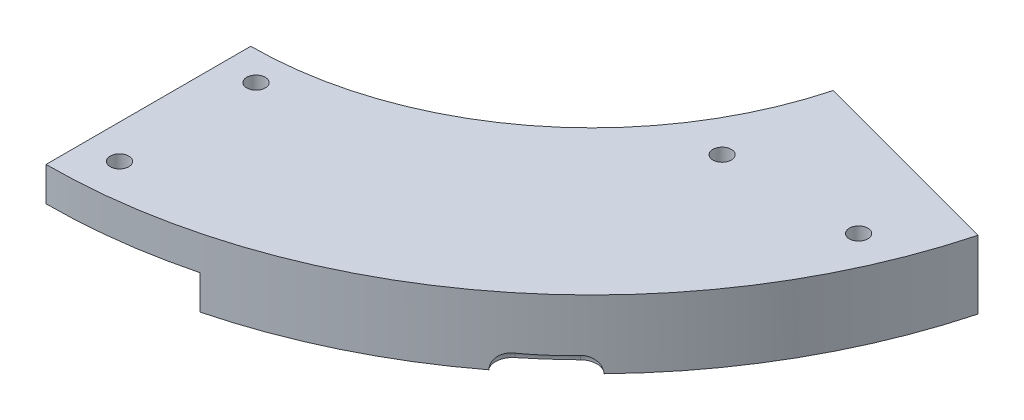
ISO-10303-21;
HEADER;
FILE_DESCRIPTION(('STEP AP214'),'2;1');
FILE_NAME('part.step','',(''),(''),'','','');
FILE_SCHEMA(('AUTOMOTIVE_DESIGN { 1 0 10303 214 1 1 1 1 }'));
ENDSEC;
DATA;
#1=APPLICATION_CONTEXT('core data for automotive mechanical design processes');
#2=APPLICATION_PROTOCOL_DEFINITION('international standard','automotive_design',2000,#1);
#3=PRODUCT_CONTEXT('',#1,'mechanical');
#4=PRODUCT('Part','Part','',(#3));
#5=PRODUCT_RELATED_PRODUCT_CATEGORY('part','',(#4));
#6=PRODUCT_DEFINITION_FORMATION('','',#4);
#7=PRODUCT_DEFINITION_CONTEXT('part definition',#1,'design');
#8=PRODUCT_DEFINITION('design','',#6,#7);
#9=PRODUCT_DEFINITION_SHAPE('','',#8);
#10=(LENGTH_UNIT() NAMED_UNIT(*) SI_UNIT(.MILLI.,.METRE.));
#11=(NAMED_UNIT(*) PLANE_ANGLE_UNIT() SI_UNIT($,.RADIAN.));
#12=(NAMED_UNIT(*) SI_UNIT($,.STERADIAN.) SOLID_ANGLE_UNIT());
#13=UNCERTAINTY_MEASURE_WITH_UNIT(LENGTH_MEASURE(1.E-05),#10,'distance_accuracy_value','');
#14=(GEOMETRIC_REPRESENTATION_CONTEXT(3) GLOBAL_UNCERTAINTY_ASSIGNED_CONTEXT((#13)) GLOBAL_UNIT_ASSIGNED_CONTEXT((#10,
#11,#12)) REPRESENTATION_CONTEXT('',''));
#15=CARTESIAN_POINT('',(0.,0.,0.));
#16=DIRECTION('',(0.,0.,1.));
#17=DIRECTION('',(1.,0.,0.));
#18=AXIS2_PLACEMENT_3D('',#15,#16,#17);
#19=CARTESIAN_POINT('',(0.,-6.35,0.));
#20=DIRECTION('',(0.,1.,0.));
#21=DIRECTION('',(0.,0.,1.));
#22=AXIS2_PLACEMENT_3D('',#19,#20,#21);
#23=PLANE('',#22);
#24=CARTESIAN_POINT('',(-6.34999999999999,-6.35,-94.267465262));
#25=DIRECTION('',(0.,1.,0.));
#26=DIRECTION('',(0.,0.,1.));
#27=AXIS2_PLACEMENT_3D('',#24,#25,#26);
#28=CIRCLE('',#27,101.6);
#29=CARTESIAN_POINT('',(91.7880639509695,-6.35,-67.9714502795843));
#30=VERTEX_POINT('',#29);
#31=CARTESIAN_POINT('',(66.609934624812,-6.35,-23.5609737669247));
#32=VERTEX_POINT('',#31);
#33=EDGE_CURVE('E157',#30,#32,#28,.F.);
#34=ORIENTED_EDGE('',*,*,#33,.T.);
#35=CARTESIAN_POINT('',(64.3650015378368,-6.35,-21.3157788010022));
#36=DIRECTION('',(0.,1.,0.));
#37=DIRECTION('',(0.,0.,1.));
#38=AXIS2_PLACEMENT_3D('',#35,#36,#37);
#39=CIRCLE('',#38,3.17500000000001);
#40=CARTESIAN_POINT('',(62.1551577397794,-6.35,-23.5955190029084));
#41=VERTEX_POINT('',#40);
#42=EDGE_CURVE('E144',#32,#41,#39,.T.);
#43=ORIENTED_EDGE('',*,*,#42,.T.);
#44=CARTESIAN_POINT('',(-6.34999999999999,-6.35,-94.267465262));
#45=DIRECTION('',(0.,1.,0.));
#46=DIRECTION('',(0.,0.,1.));
#47=AXIS2_PLACEMENT_3D('',#44,#45,#46);
#48=CIRCLE('',#47,98.425);
#49=CARTESIAN_POINT('',(55.7350089646732,-6.35,-17.8938291900122));
#50=VERTEX_POINT('',#49);
#51=EDGE_CURVE('E360',#41,#50,#48,.F.);
#52=ORIENTED_EDGE('',*,*,#51,.T.);
#53=CARTESIAN_POINT('',(57.7377511893401,-6.35,-15.4301635102706));
#54=DIRECTION('',(0.,1.,0.));
#55=DIRECTION('',(0.,0.,1.));
#56=AXIS2_PLACEMENT_3D('',#53,#54,#55);
#57=CIRCLE('',#56,3.175);
#58=CARTESIAN_POINT('',(55.2430934211356,-6.35,-13.4661605521423));
#59=VERTEX_POINT('',#58);
#60=EDGE_CURVE('E152',#50,#59,#57,.T.);
#61=ORIENTED_EDGE('',*,*,#60,.T.);
#62=CARTESIAN_POINT('',(19.05,-6.35,4.1063117316684));
#63=VERTEX_POINT('',#62);
#64=EDGE_CURVE('E165',#59,#63,#28,.F.);
#65=ORIENTED_EDGE('',*,*,#64,.T.);
#66=DIRECTION('',(0.,0.,-1.));
#67=VECTOR('',#66,1.);
#68=CARTESIAN_POINT('',(19.05,-6.35,0.));
#69=LINE('',#68,#67);
#70=CARTESIAN_POINT('',(19.05,-6.35000000000001,-9.32758866940955));
#71=VERTEX_POINT('',#70);
#72=EDGE_CURVE('E169',#63,#71,#69,.T.);
#73=ORIENTED_EDGE('',*,*,#72,.T.);
#74=CARTESIAN_POINT('',(59.2307860808822,-6.34999999999998,-34.6092496575072));
#75=CARTESIAN_POINT('',(53.9014840663634,-6.34999999999998,-28.753781836006));
#76=CARTESIAN_POINT('',(47.7126525344251,-6.34999999999998,-23.5402136265929));
#77=CARTESIAN_POINT('',(34.0840577834186,-6.34999999999998,-14.9609190133976));
#78=CARTESIAN_POINT('',(26.6877525453769,-6.34999999999671,-11.6096261559123));
#79=CARTESIAN_POINT('',(18.6746195889176,-6.35000000000014,-9.21543378527847));
#80=CARTESIAN_POINT('',(18.296166475289,-6.34999999999998,-9.10439786983044));
#81=CARTESIAN_POINT('',(17.9206079167567,-6.34999999999998,-8.99642515905449));
#82=B_SPLINE_CURVE_WITH_KNOTS('',3,(#74,#75,#76,#77,#78,#79,#80,#81),.UNSPECIFIED.,.F.,.F.,(4,2,
2,4),(0.,0.488007694164067,0.976015388328135,1.),.UNSPECIFIED.);
#83=CARTESIAN_POINT('',(59.2307860808822,-6.34999999999999,-34.6092496575072));
#84=VERTEX_POINT('',#83);
#85=EDGE_CURVE('E268',#84,#71,#82,.T.);
#86=ORIENTED_EDGE('',*,*,#85,.F.);
#87=DIRECTION('',(0.515920464794379,0.,0.856636488836631));
#88=VECTOR('',#87,1.);
#89=CARTESIAN_POINT('',(64.0430813094094,-6.35,-26.6188946142084));
#90=LINE('',#89,#88);
#91=CARTESIAN_POINT('',(54.063522539709,-6.35,-43.1889955657612));
#92=VERTEX_POINT('',#91);
#93=EDGE_CURVE('E275',#92,#84,#90,.T.);
#94=ORIENTED_EDGE('',*,*,#93,.F.);
#95=CARTESIAN_POINT('',(54.063522539709,-6.34999999999998,-43.1889955657612));
#96=CARTESIAN_POINT('',(49.5107747784138,-6.34999999999998,-37.8008034006709));
#97=CARTESIAN_POINT('',(44.1383057302959,-6.34999999999998,-32.9416564163539));
#98=CARTESIAN_POINT('',(32.2865263150446,-6.34999999999998,-24.8569769230008));
#99=CARTESIAN_POINT('',(25.7750626710049,-6.34999999999998,-21.6252465632108));
#100=CARTESIAN_POINT('',(18.7194764886662,-6.34999999999998,-19.2310542036305));
#101=CARTESIAN_POINT('',(18.3817175174875,-6.34999999999998,-19.1197151915227));
#102=CARTESIAN_POINT('',(18.0455634429701,-6.34999999999998,-19.011266069953));
#103=B_SPLINE_CURVE_WITH_KNOTS('',3,(#95,#96,#97,#98,#99,#100,#101,#102),.UNSPECIFIED.,.F.,.F.,
(4,2,2,4),(0.,0.488007694164067,0.976015388328135,1.),.UNSPECIFIED.);
#104=CARTESIAN_POINT('',(19.0499998347804,-6.35,-19.3432110988143));
#105=VERTEX_POINT('',#104);
#106=EDGE_CURVE('E73',#92,#105,#103,.T.);
#107=ORIENTED_EDGE('',*,*,#106,.T.);
#108=CARTESIAN_POINT('',(19.05,-6.35,-29.179965262));
#109=VERTEX_POINT('',#108);
#110=EDGE_CURVE('E227',#105,#109,#69,.T.);
#111=ORIENTED_EDGE('',*,*,#110,.T.);
#112=CARTESIAN_POINT('',(19.05,-6.35,-30.767465262));
#113=DIRECTION('',(0.,1.,0.));
#114=DIRECTION('',(0.,0.,1.));
#115=AXIS2_PLACEMENT_3D('',#112,#113,#114);
#116=CIRCLE('',#115,1.5875);
#117=CARTESIAN_POINT('',(17.6278728360681,-6.35,-31.472951321116));
#118=VERTEX_POINT('',#117);
#119=EDGE_CURVE('E229',#118,#109,#116,.F.);
#120=ORIENTED_EDGE('',*,*,#119,.F.);
#121=DIRECTION('',(-0.895828134760231,0.,-0.444400667159721));
#122=VECTOR('',#121,1.);
#123=CARTESIAN_POINT('',(16.0109533285498,-6.35,-32.2750695846567));
#124=LINE('',#123,#122);
#125=CARTESIAN_POINT('',(12.9770144535497,-6.35,-33.7801400416509));
#126=VERTEX_POINT('',#125);
#127=EDGE_CURVE('E186',#118,#126,#124,.T.);
#128=ORIENTED_EDGE('',*,*,#127,.T.);
#129=CARTESIAN_POINT('',(-6.34999999999999,-6.35,-94.267465262));
#130=DIRECTION('',(0.,1.,0.));
#131=DIRECTION('',(0.,0.,1.));
#132=AXIS2_PLACEMENT_3D('',#129,#130,#131);
#133=CIRCLE('',#132,63.5);
#134=CARTESIAN_POINT('',(54.9862899693559,-6.35,-77.8324558979902));
#135=VERTEX_POINT('',#134);
#136=EDGE_CURVE('E167',#135,#126,#133,.F.);
#137=ORIENTED_EDGE('',*,*,#136,.F.);
#138=DIRECTION('',(-0.965925826289069,0.,-0.258819045102517));
#139=VECTOR('',#138,1.);
#140=CARTESIAN_POINT('',(23.1414969725153,-6.35,-86.3652424646298));
#141=LINE('',#140,#139);
#142=EDGE_CURVE('E164',#30,#135,#141,.T.);
#143=ORIENTED_EDGE('',*,*,#142,.F.);
#144=EDGE_LOOP('',(#34,#43,#52,#61,#65,#73,#86,#94,#107,#111,#120,#128,#137,#143));
#145=FACE_BOUND('',#144,.T.);
#146=CARTESIAN_POINT('',(80.391,-6.35,-57.15));
#147=DIRECTION('',(0.,-1.,0.));
#148=DIRECTION('',(0.,0.,-1.));
#149=AXIS2_PLACEMENT_3D('',#146,#147,#148);
#150=CIRCLE('',#149,1.72719999999998);
#151=CARTESIAN_POINT('',(80.391,-6.35,-58.8772));
#152=VERTEX_POINT('',#151);
#153=EDGE_CURVE('E381',#152,#152,#150,.T.);
#154=ORIENTED_EDGE('',*,*,#153,.F.);
#155=EDGE_LOOP('',(#154));
#156=FACE_BOUND('',#155,.T.);
#157=CARTESIAN_POINT('',(54.991,-6.35,-57.15));
#158=DIRECTION('',(0.,-1.,0.));
#159=DIRECTION('',(0.,0.,-1.));
#160=AXIS2_PLACEMENT_3D('',#157,#158,#159);
#161=CIRCLE('',#160,1.72719999999999);
#162=CARTESIAN_POINT('',(54.991,-6.35,-58.8772));
#163=VERTEX_POINT('',#162);
#164=EDGE_CURVE('E387',#163,#163,#161,.T.);
#165=ORIENTED_EDGE('',*,*,#164,.F.);
#166=EDGE_LOOP('',(#165));
#167=FACE_BOUND('',#166,.T.);
#168=ADVANCED_FACE('F47',(#145,#156,#167),#23,.F.);
#169=CARTESIAN_POINT('',(19.05,-6.35,0.));
#170=DIRECTION('',(1.,0.,0.));
#171=DIRECTION('',(0.,0.,-1.));
#172=AXIS2_PLACEMENT_3D('',#169,#170,#171);
#173=PLANE('',#172);
#174=CARTESIAN_POINT('',(19.05,-6.34999999999998,-9.32759127987919));
#175=CARTESIAN_POINT('',(19.05,-6.34877044993828,-9.43975511956092));
#176=CARTESIAN_POINT('',(19.05,-6.34691619703676,-9.55193077200282));
#177=CARTESIAN_POINT('',(19.05,-6.34099239613251,-9.77726515650753));
#178=CARTESIAN_POINT('',(19.05,-6.33690239360589,-9.89042332273259));
#179=CARTESIAN_POINT('',(19.05,-6.3255017358533,-10.1171280988849));
#180=CARTESIAN_POINT('',(19.05,-6.31817588974514,-10.2306740040092));
#181=CARTESIAN_POINT('',(19.05,-6.29910536732891,-10.4575383845618));
#182=CARTESIAN_POINT('',(19.05,-6.28735576226616,-10.5708564640558));
#183=CARTESIAN_POINT('',(19.05,-6.25878012851775,-10.792168942808));
#184=CARTESIAN_POINT('',(19.05,-6.24218087419835,-10.9001918510583));
#185=CARTESIAN_POINT('',(19.05,-6.20277258175003,-11.1148203313904));
#186=CARTESIAN_POINT('',(19.05,-6.17998032744271,-11.2214289290464));
#187=CARTESIAN_POINT('',(19.05,-6.12743804971736,-11.432669678993));
#188=CARTESIAN_POINT('',(19.05,-6.09770431840141,-11.5373058485731));
#189=CARTESIAN_POINT('',(19.05,-6.03089201337944,-11.7441343909997));
#190=CARTESIAN_POINT('',(19.05,-5.99381898811404,-11.8463285449785));
#191=CARTESIAN_POINT('',(19.05,-5.92559448921612,-12.0151972175897));
#192=CARTESIAN_POINT('',(19.05,-5.89640437976236,-12.0826722141205));
#193=CARTESIAN_POINT('',(19.05,-5.83483658282869,-12.2162040070094));
#194=CARTESIAN_POINT('',(19.05,-5.80245694374324,-12.282259904565));
#195=CARTESIAN_POINT('',(19.05,-5.73474200887846,-12.4128013177297));
#196=CARTESIAN_POINT('',(19.05,-5.699407864708,-12.4772874326718));
#197=CARTESIAN_POINT('',(19.05,-5.62588151295779,-12.6049654701701));
#198=CARTESIAN_POINT('',(19.05,-5.5876780601153,-12.6681509163208));
#199=CARTESIAN_POINT('',(19.05,-5.50876580347631,-12.7929237672376));
#200=CARTESIAN_POINT('',(19.05,-5.46805698622041,-12.8545111634161));
#201=CARTESIAN_POINT('',(19.05,-5.38560136866745,-12.9769895708319));
#202=CARTESIAN_POINT('',(19.05,-5.343854367624,-13.0378804440114));
#203=CARTESIAN_POINT('',(19.05,-5.26442749027631,-13.1542428387078));
#204=CARTESIAN_POINT('',(19.05,-5.22672578492974,-13.2096991614335));
#205=CARTESIAN_POINT('',(19.05,-5.15245577009184,-13.3213847345521));
#206=CARTESIAN_POINT('',(19.05,-5.11588761597703,-13.3776140893936));
#207=CARTESIAN_POINT('',(19.05,-5.04504274545358,-13.4913577568436));
#208=CARTESIAN_POINT('',(19.05,-5.01076135869607,-13.5488691091202));
#209=CARTESIAN_POINT('',(19.05,-4.94581968454603,-13.6658741605996));
#210=CARTESIAN_POINT('',(19.05,-4.91515686880926,-13.72536643799));
#211=CARTESIAN_POINT('',(19.05,-4.85812485743782,-13.8496229488073));
#212=CARTESIAN_POINT('',(19.05,-4.83199803778249,-13.9145038974147));
#213=CARTESIAN_POINT('',(19.05,-4.79969194226115,-14.0140103700586));
#214=CARTESIAN_POINT('',(19.05,-4.790075334711,-14.0475168825955));
#215=CARTESIAN_POINT('',(19.05,-4.77360863456636,-14.1152117216461));
#216=CARTESIAN_POINT('',(19.05,-4.76675795713493,-14.1493999024197));
#217=CARTESIAN_POINT('',(19.05,-4.75706545039511,-14.2133029068063));
#218=CARTESIAN_POINT('',(19.05,-4.75378751840878,-14.2429506243572));
#219=CARTESIAN_POINT('',(19.05,-4.74992970234322,-14.3024139100861));
#220=CARTESIAN_POINT('',(19.05,-4.74934872913819,-14.3322294056383));
#221=CARTESIAN_POINT('',(19.05,-4.75182059526889,-14.4214142277704));
#222=CARTESIAN_POINT('',(19.05,-4.75906226125519,-14.4806839274736));
#223=CARTESIAN_POINT('',(19.05,-4.78757401654163,-14.6238848869327));
#224=CARTESIAN_POINT('',(19.05,-4.81372536447771,-14.7067765502434));
#225=CARTESIAN_POINT('',(19.05,-4.86164012074288,-14.8278629908574));
#226=CARTESIAN_POINT('',(19.05,-4.87918561175012,-14.8679030807019));
#227=CARTESIAN_POINT('',(19.05,-4.91652810011912,-14.9469032558564));
#228=CARTESIAN_POINT('',(19.05,-4.93632365352685,-14.9858640140702));
#229=CARTESIAN_POINT('',(19.05,-4.98011961530697,-15.0675334919055));
#230=CARTESIAN_POINT('',(19.05,-5.00433874289198,-15.1101229729653));
#231=CARTESIAN_POINT('',(19.05,-5.05431162869136,-15.1943965989881));
#232=CARTESIAN_POINT('',(19.05,-5.08006568384121,-15.2360805666353));
#233=CARTESIAN_POINT('',(19.05,-5.15893743845551,-15.3602360841168));
#234=CARTESIAN_POINT('',(19.05,-5.21360756423976,-15.4417104588864));
#235=CARTESIAN_POINT('',(19.05,-5.29639571516648,-15.5634645692969));
#236=CARTESIAN_POINT('',(19.05,-5.32414629891594,-15.6040074659781));
#237=CARTESIAN_POINT('',(19.05,-5.37953878549608,-15.6851715569525));
#238=CARTESIAN_POINT('',(19.05,-5.40718068510752,-15.7257927535127));
#239=CARTESIAN_POINT('',(19.05,-5.46199615984555,-15.8073883751621));
#240=CARTESIAN_POINT('',(19.05,-5.4891694387988,-15.8483630007325));
#241=CARTESIAN_POINT('',(19.05,-5.54253718739959,-15.9309449283161));
#242=CARTESIAN_POINT('',(19.05,-5.56873171855971,-15.9725521903371));
#243=CARTESIAN_POINT('',(19.05,-5.61954362028558,-16.0557998323216));
#244=CARTESIAN_POINT('',(19.05,-5.64417963704127,-16.0974288118073));
#245=CARTESIAN_POINT('',(19.05,-5.69227707343041,-16.1813613435385));
#246=CARTESIAN_POINT('',(19.05,-5.71573842689181,-16.2236649336101));
#247=CARTESIAN_POINT('',(19.05,-5.78426143731401,-16.3516261481783));
#248=CARTESIAN_POINT('',(19.05,-5.82744325539144,-16.4383036054415));
#249=CARTESIAN_POINT('',(19.05,-5.90826895682044,-16.6141382494852));
#250=CARTESIAN_POINT('',(19.05,-5.9459161908351,-16.7032938967552));
#251=CARTESIAN_POINT('',(19.05,-6.0153723510886,-16.883728164841));
#252=CARTESIAN_POINT('',(19.05,-6.04718852397859,-16.9750039895342));
#253=CARTESIAN_POINT('',(19.05,-6.09815420517401,-17.1374463040669));
#254=CARTESIAN_POINT('',(19.05,-6.11851696899575,-17.2082359991626));
#255=CARTESIAN_POINT('',(19.05,-6.15599581587932,-17.350672464299));
#256=CARTESIAN_POINT('',(19.05,-6.17311173894412,-17.4223192763918));
#257=CARTESIAN_POINT('',(19.05,-6.20430963450578,-17.5663336381067));
#258=CARTESIAN_POINT('',(19.05,-6.21838885287876,-17.6387017802318));
#259=CARTESIAN_POINT('',(19.05,-6.24378437073793,-17.7840156327186));
#260=CARTESIAN_POINT('',(19.05,-6.25509700085172,-17.8569619790708));
#261=CARTESIAN_POINT('',(19.05,-6.27526724099159,-18.0032815814091));
#262=CARTESIAN_POINT('',(19.05,-6.2841217823838,-18.0766552552952));
#263=CARTESIAN_POINT('',(19.05,-6.30033791486185,-18.2296630303017));
#264=CARTESIAN_POINT('',(19.05,-6.30751708297262,-18.3093162127117));
#265=CARTESIAN_POINT('',(19.05,-6.31980546301345,-18.4687530121299));
#266=CARTESIAN_POINT('',(19.05,-6.32491532103713,-18.5485365806043));
#267=CARTESIAN_POINT('',(19.05,-6.33346530599267,-18.7080501494635));
#268=CARTESIAN_POINT('',(19.05,-6.33690834883233,-18.7877799979509));
#269=CARTESIAN_POINT('',(19.05,-6.34249665501377,-18.9470020855166));
#270=CARTESIAN_POINT('',(19.05,-6.34464643971849,-19.0264941741518));
#271=CARTESIAN_POINT('',(19.05,-6.34796911453025,-19.1850615902752));
#272=CARTESIAN_POINT('',(19.05,-6.349147317236,-19.2641368030509));
#273=CARTESIAN_POINT('',(19.05,-6.34999999999998,-19.3432116977134));
#274=B_SPLINE_CURVE_WITH_KNOTS('',3,(#174,#175,#176,#177,#178,#179,#180,#181,#182,#183,#184,
#185,#186,#187,#188,#189,#190,#191,#192,#193,#194,#195,#196,#197,#198,#199,#200,#201,#202,#203,
#204,#205,#206,#207,#208,#209,#210,#211,#212,#213,#214,#215,#216,#217,#218,#219,#220,#221,#222,
#223,#224,#225,#226,#227,#228,#229,#230,#231,#232,#233,#234,#235,#236,#237,#238,#239,#240,#241,
#242,#243,#244,#245,#246,#247,#248,#249,#250,#251,#252,#253,#254,#255,#256,#257,#258,#259,#260,
#261,#262,#263,#264,#265,#266,#267,#268,#269,#270,#271,#272,#273),.UNSPECIFIED.,.F.,.F.,(4,2,2,
2,2,2,2,2,2,2,2,2,2,2,2,2,2,2,2,2,2,2,2,2,2,2,2,2,2,2,2,2,2,2,2,2,2,2,2,2,2,2,2,2,2,2,2,2,2,4),
(0.,0.33653894471456,0.676209654337335,1.01749220520341,1.35915612850659,1.68687464878332,
2.01371371910203,2.33979325492401,2.66562721247959,2.88610421286083,3.10671696647942,
3.32724412682608,3.54868585943983,3.77012878179348,3.99161486117681,4.19278570974306,
4.39398401206495,4.59475795350605,4.79539077033413,5.00468131198282,5.10916671579987,
5.21363001531121,5.30300516352542,5.39234421580322,5.57053841702862,5.82975187467556,
5.9608693111356,6.09190307442065,6.2388452307864,6.3858159063228,6.68010434116102,
6.82750058248743,6.97490115732465,7.1223917081208,7.26987297374777,7.41497097012355,
7.56007713109804,7.85039704617334,8.14054046994653,8.43032083104868,8.65122560558994,
8.87214126299623,9.09325644400447,9.31466332236302,9.53634537071466,9.77624018987288,
10.0160600496339,10.2554588414096,10.4940157314633,10.7312593800441),.UNSPECIFIED.);
#275=EDGE_CURVE('E181',#71,#105,#274,.T.);
#276=ORIENTED_EDGE('',*,*,#275,.F.);
#277=ORIENTED_EDGE('',*,*,#72,.F.);
#278=DIRECTION('',(0.,1.,0.));
#279=VECTOR('',#278,1.);
#280=CARTESIAN_POINT('',(19.05,-6.35,4.1063117316684));
#281=LINE('',#280,#279);
#282=CARTESIAN_POINT('',(19.05,0.,4.10631173166838));
#283=VERTEX_POINT('',#282);
#284=EDGE_CURVE('E191',#63,#283,#281,.T.);
#285=ORIENTED_EDGE('',*,*,#284,.T.);
#286=DIRECTION('',(0.,0.,-1.));
#287=VECTOR('',#286,1.);
#288=CARTESIAN_POINT('',(19.05,0.,0.));
#289=LINE('',#288,#287);
#290=CARTESIAN_POINT('',(19.05,0.,-29.179965262));
#291=VERTEX_POINT('',#290);
#292=EDGE_CURVE('E183',#283,#291,#289,.T.);
#293=ORIENTED_EDGE('',*,*,#292,.T.);
#294=DIRECTION('',(0.,1.,0.));
#295=VECTOR('',#294,1.);
#296=CARTESIAN_POINT('',(19.05,-6.35,-29.179965262));
#297=LINE('',#296,#295);
#298=EDGE_CURVE('E194',#109,#291,#297,.T.);
#299=ORIENTED_EDGE('',*,*,#298,.F.);
#300=ORIENTED_EDGE('',*,*,#110,.F.);
#301=EDGE_LOOP('',(#276,#277,#285,#293,#299,#300));
#302=FACE_BOUND('',#301,.T.);
#303=ADVANCED_FACE('F310',(#302),#173,.F.);
#304=CARTESIAN_POINT('',(0.,0.,0.));
#305=DIRECTION('',(0.,1.,0.));
#306=DIRECTION('',(0.,0.,1.));
#307=AXIS2_PLACEMENT_3D('',#304,#305,#306);
#308=PLANE('',#307);
#309=CARTESIAN_POINT('',(0.,0.,0.));
#310=DIRECTION('',(0.,1.,0.));
#311=DIRECTION('',(0.,0.,1.));
#312=AXIS2_PLACEMENT_3D('',#309,#310,#311);
#313=CIRCLE('',#312,1.72719999999999);
#314=CARTESIAN_POINT('',(0.,0.,1.72719999999999));
#315=VERTEX_POINT('',#314);
#316=EDGE_CURVE('E372',#315,#315,#313,.T.);
#317=ORIENTED_EDGE('',*,*,#316,.T.);
#318=EDGE_LOOP('',(#317));
#319=FACE_BOUND('',#318,.T.);
#320=CARTESIAN_POINT('',(0.,0.,-25.4));
#321=DIRECTION('',(0.,1.,0.));
#322=DIRECTION('',(0.,0.,1.));
#323=AXIS2_PLACEMENT_3D('',#320,#321,#322);
#324=CIRCLE('',#323,1.72719999999999);
#325=CARTESIAN_POINT('',(0.,0.,-23.6728));
#326=VERTEX_POINT('',#325);
#327=EDGE_CURVE('E363',#326,#326,#324,.T.);
#328=ORIENTED_EDGE('',*,*,#327,.T.);
#329=EDGE_LOOP('',(#328));
#330=FACE_BOUND('',#329,.T.);
#331=DIRECTION('',(-0.895828134760231,0.,-0.444400667159721));
#332=VECTOR('',#331,1.);
#333=CARTESIAN_POINT('',(16.0109533285498,0.,-32.2750695846567));
#334=LINE('',#333,#332);
#335=CARTESIAN_POINT('',(17.6278728360681,0.,-31.472951321116));
#336=VERTEX_POINT('',#335);
#337=CARTESIAN_POINT('',(12.9770144535497,0.,-33.7801400416509));
#338=VERTEX_POINT('',#337);
#339=EDGE_CURVE('E177',#336,#338,#334,.T.);
#340=ORIENTED_EDGE('',*,*,#339,.F.);
#341=CARTESIAN_POINT('',(19.05,0.,-30.767465262));
#342=DIRECTION('',(0.,1.,0.));
#343=DIRECTION('',(0.,0.,1.));
#344=AXIS2_PLACEMENT_3D('',#341,#342,#343);
#345=CIRCLE('',#344,1.5875);
#346=EDGE_CURVE('E180',#336,#291,#345,.F.);
#347=ORIENTED_EDGE('',*,*,#346,.T.);
#348=ORIENTED_EDGE('',*,*,#292,.F.);
#349=CARTESIAN_POINT('',(-6.34999999999999,0.,-94.267465262));
#350=DIRECTION('',(0.,1.,0.));
#351=DIRECTION('',(0.,0.,1.));
#352=AXIS2_PLACEMENT_3D('',#349,#350,#351);
#353=CIRCLE('',#352,101.6);
#354=CARTESIAN_POINT('',(-6.35,0.,7.332534738));
#355=VERTEX_POINT('',#354);
#356=EDGE_CURVE('E202',#283,#355,#353,.F.);
#357=ORIENTED_EDGE('',*,*,#356,.T.);
#358=DIRECTION('',(0.,0.,-1.));
#359=VECTOR('',#358,1.);
#360=CARTESIAN_POINT('',(-6.35,0.,0.));
#361=LINE('',#360,#359);
#362=CARTESIAN_POINT('',(-6.35,0.,-30.767465262));
#363=VERTEX_POINT('',#362);
#364=EDGE_CURVE('E212',#355,#363,#361,.T.);
#365=ORIENTED_EDGE('',*,*,#364,.T.);
#366=CARTESIAN_POINT('',(-6.34999999999999,0.,-94.267465262));
#367=DIRECTION('',(0.,1.,0.));
#368=DIRECTION('',(0.,0.,1.));
#369=AXIS2_PLACEMENT_3D('',#366,#367,#368);
#370=CIRCLE('',#369,63.5);
#371=EDGE_CURVE('E190',#338,#363,#370,.F.);
#372=ORIENTED_EDGE('',*,*,#371,.F.);
#373=EDGE_LOOP('',(#340,#347,#348,#357,#365,#372));
#374=FACE_BOUND('',#373,.T.);
#375=ADVANCED_FACE('F315',(#319,#330,#374),#308,.F.);
#376=CARTESIAN_POINT('',(-6.34999999999999,6.35,-94.267465262));
#377=DIRECTION('',(0.,-1.,0.));
#378=DIRECTION('',(0.,0.,-1.));
#379=AXIS2_PLACEMENT_3D('',#376,#377,#378);
#380=CYLINDRICAL_SURFACE('',#379,63.5);
#381=DIRECTION('',(0.,-1.,0.));
#382=VECTOR('',#381,1.);
#383=CARTESIAN_POINT('',(54.9862899693559,6.35,-77.8324558979902));
#384=LINE('',#383,#382);
#385=CARTESIAN_POINT('',(54.9862899693559,6.35,-77.8324558979902));
#386=VERTEX_POINT('',#385);
#387=EDGE_CURVE('E210',#386,#135,#384,.T.);
#388=ORIENTED_EDGE('',*,*,#387,.T.);
#389=ORIENTED_EDGE('',*,*,#136,.T.);
#390=DIRECTION('',(0.,1.,0.));
#391=VECTOR('',#390,1.);
#392=CARTESIAN_POINT('',(12.9770144535497,-6.35,-33.7801400416509));
#393=LINE('',#392,#391);
#394=EDGE_CURVE('E187',#126,#338,#393,.T.);
#395=ORIENTED_EDGE('',*,*,#394,.T.);
#396=ORIENTED_EDGE('',*,*,#371,.T.);
#397=DIRECTION('',(0.,-1.,0.));
#398=VECTOR('',#397,1.);
#399=CARTESIAN_POINT('',(-6.35,6.35,-30.767465262));
#400=LINE('',#399,#398);
#401=CARTESIAN_POINT('',(-6.35,6.35,-30.767465262));
#402=VERTEX_POINT('',#401);
#403=EDGE_CURVE('E222',#402,#363,#400,.T.);
#404=ORIENTED_EDGE('',*,*,#403,.F.);
#405=CARTESIAN_POINT('',(-6.34999999999999,6.35,-94.267465262));
#406=DIRECTION('',(0.,1.,0.));
#407=DIRECTION('',(0.,0.,1.));
#408=AXIS2_PLACEMENT_3D('',#405,#406,#407);
#409=CIRCLE('',#408,63.5);
#410=EDGE_CURVE('E199',#386,#402,#409,.F.);
#411=ORIENTED_EDGE('',*,*,#410,.F.);
#412=EDGE_LOOP('',(#388,#389,#395,#396,#404,#411));
#413=FACE_BOUND('',#412,.T.);
#414=ADVANCED_FACE('F49',(#413),#380,.F.);
#415=CARTESIAN_POINT('',(-6.35,6.35,0.));
#416=DIRECTION('',(-1.,0.,0.));
#417=DIRECTION('',(0.,0.,1.));
#418=AXIS2_PLACEMENT_3D('',#415,#416,#417);
#419=PLANE('',#418);
#420=ORIENTED_EDGE('',*,*,#364,.F.);
#421=DIRECTION('',(0.,-1.,0.));
#422=VECTOR('',#421,1.);
#423=CARTESIAN_POINT('',(-6.35,6.35,7.332534738));
#424=LINE('',#423,#422);
#425=CARTESIAN_POINT('',(-6.35,6.35,7.332534738));
#426=VERTEX_POINT('',#425);
#427=EDGE_CURVE('E219',#426,#355,#424,.T.);
#428=ORIENTED_EDGE('',*,*,#427,.F.);
#429=DIRECTION('',(0.,0.,-1.));
#430=VECTOR('',#429,1.);
#431=CARTESIAN_POINT('',(-6.35,6.35,0.));
#432=LINE('',#431,#430);
#433=EDGE_CURVE('E201',#426,#402,#432,.T.);
#434=ORIENTED_EDGE('',*,*,#433,.T.);
#435=ORIENTED_EDGE('',*,*,#403,.T.);
#436=EDGE_LOOP('',(#420,#428,#434,#435));
#437=FACE_BOUND('',#436,.T.);
#438=ADVANCED_FACE('F321',(#437),#419,.T.);
#439=CARTESIAN_POINT('',(-6.34999999999999,6.35,-94.267465262));
#440=DIRECTION('',(0.,-1.,0.));
#441=DIRECTION('',(0.,0.,-1.));
#442=AXIS2_PLACEMENT_3D('',#439,#440,#441);
#443=CYLINDRICAL_SURFACE('',#442,101.6);
#444=CARTESIAN_POINT('',(66.609934624812,-6.35,-23.5609737669247));
#445=CARTESIAN_POINT('',(66.6099322914893,-6.34994364609906,-23.5609713592381));
#446=CARTESIAN_POINT('',(66.6099299571175,-6.34988729228781,-23.5609689504691));
#447=CARTESIAN_POINT('',(66.6099248637704,-6.34976438979028,-23.5609636947962));
#448=CARTESIAN_POINT('',(66.6099221043813,-6.34969784113942,-23.5609608474652));
#449=CARTESIAN_POINT('',(66.6099083001211,-6.34936509850946,-23.5609466032641));
#450=CARTESIAN_POINT('',(66.6098972333061,-6.34909890640943,-23.5609351837557));
#451=CARTESIAN_POINT('',(66.6098417821869,-6.34776795584443,-23.5608779654664));
#452=CARTESIAN_POINT('',(66.6097970467666,-6.34670322756747,-23.5608318044602));
#453=CARTESIAN_POINT('',(66.6095714970101,-6.34137974133681,-23.5605990675512));
#454=CARTESIAN_POINT('',(66.6093850657219,-6.33712147331932,-23.5604066970603));
#455=CARTESIAN_POINT('',(66.6084229261323,-6.31583238417126,-23.5594139144745));
#456=CARTESIAN_POINT('',(66.6075573332808,-6.29880988236194,-23.5585207789504));
#457=CARTESIAN_POINT('',(66.602748826577,-6.21371808089179,-23.5535594933934));
#458=CARTESIAN_POINT('',(66.5973684472175,-6.14581136006388,-23.548008814251));
#459=CARTESIAN_POINT('',(66.5765108152607,-5.94172994844239,-23.5264979811647));
#460=CARTESIAN_POINT('',(66.5563314044495,-5.80648405768621,-23.5056939519115));
#461=CARTESIAN_POINT('',(66.5038038860815,-5.54075442330828,-23.4516148939714));
#462=CARTESIAN_POINT('',(66.4714346009867,-5.41027940345451,-23.4183181620159));
#463=CARTESIAN_POINT('',(66.3839729961097,-5.11985097457476,-23.3285184349577));
#464=CARTESIAN_POINT('',(66.325020931578,-4.96223381886496,-23.2680934558307));
#465=CARTESIAN_POINT('',(66.1892452842781,-4.66340618695287,-23.1293793470612));
#466=CARTESIAN_POINT('',(66.1124164919602,-4.52220051132612,-23.0510850101442));
#467=CARTESIAN_POINT('',(65.9429151001209,-4.26019405716668,-22.8790280087301));
#468=CARTESIAN_POINT('',(65.8502432829186,-4.13939227168721,-22.7852661080201));
#469=CARTESIAN_POINT('',(65.6515286038279,-3.92162111688283,-22.5851122924166));
#470=CARTESIAN_POINT('',(65.5454865356497,-3.82465033386348,-22.4787211272675));
#471=CARTESIAN_POINT('',(65.322792157992,-3.65719560851525,-22.2563854993817));
#472=CARTESIAN_POINT('',(65.2061313591349,-3.58673309394027,-22.1404334000402));
#473=CARTESIAN_POINT('',(64.9654621875259,-3.47439528056044,-21.9024635807826));
#474=CARTESIAN_POINT('',(64.8414537493446,-3.43252023636413,-21.7804458068541));
#475=CARTESIAN_POINT('',(64.5894713895703,-3.37852672245852,-21.5338246196519));
#476=CARTESIAN_POINT('',(64.4614956179687,-3.3664223530781,-21.4092200093348));
#477=CARTESIAN_POINT('',(64.2052413492271,-3.37235396285035,-21.1610378049723));
#478=CARTESIAN_POINT('',(64.0769628450247,-3.39039065224546,-21.0374602351969));
#479=CARTESIAN_POINT('',(63.8237635569656,-3.45610336671023,-20.7947922790382));
#480=CARTESIAN_POINT('',(63.6988432161073,-3.50378328239999,-20.6757024838436));
#481=CARTESIAN_POINT('',(63.4560232935394,-3.62743479772165,-20.4453334658321));
#482=CARTESIAN_POINT('',(63.3381231105335,-3.70340397024412,-20.3340535739287));
#483=CARTESIAN_POINT('',(63.1128585370725,-3.88146133625808,-20.1223697098769));
#484=CARTESIAN_POINT('',(63.0054896485669,-3.98353831097401,-20.0219610925484));
#485=CARTESIAN_POINT('',(62.8044275249567,-4.21094913252779,-19.8346494091779));
#486=CARTESIAN_POINT('',(62.710738098746,-4.33628943480015,-19.7477501042193));
#487=CARTESIAN_POINT('',(62.5399556482404,-4.60666299884479,-19.5898409841835));
#488=CARTESIAN_POINT('',(62.4628484075706,-4.75167921651115,-19.5188175561937));
#489=CARTESIAN_POINT('',(62.3614710783986,-4.98065386486946,-19.4256598259085));
#490=CARTESIAN_POINT('',(62.3300586702987,-5.05888905006579,-19.3968363128068));
#491=CARTESIAN_POINT('',(62.2721881088547,-5.21873291905502,-19.3437918181448));
#492=CARTESIAN_POINT('',(62.2457310324121,-5.30034233144777,-19.3195718370154));
#493=CARTESIAN_POINT('',(62.1995608988169,-5.46101324764347,-19.2773418086827));
#494=CARTESIAN_POINT('',(62.1795250935251,-5.5399047205723,-19.2590339946947));
#495=CARTESIAN_POINT('',(62.1442322127372,-5.69959821887417,-19.2268047827911));
#496=CARTESIAN_POINT('',(62.1289722924324,-5.78039907593117,-19.2128807735843));
#497=CARTESIAN_POINT('',(62.1099015636492,-5.9027846971634,-19.195486798036));
#498=CARTESIAN_POINT('',(62.1041758646726,-5.94383545741617,-19.1902659733074));
#499=CARTESIAN_POINT('',(62.0941030594114,-6.02623839177153,-19.1810829883006));
#500=CARTESIAN_POINT('',(62.0897555791013,-6.06759048097676,-19.1771204865341));
#501=CARTESIAN_POINT('',(62.0826138283686,-6.15061755135773,-19.170611872014));
#502=CARTESIAN_POINT('',(62.0798221444588,-6.19229295413468,-19.1680681179241));
#503=CARTESIAN_POINT('',(62.0761124076327,-6.27582761145253,-19.1646880609893));
#504=CARTESIAN_POINT('',(62.0751959551965,-6.31768699251008,-19.1638532166714));
#505=CARTESIAN_POINT('',(62.0753745657074,-6.35956710731994,-19.1640158369394));
#506=B_SPLINE_CURVE_WITH_KNOTS('',3,(#444,#445,#446,#447,#448,#449,#450,#451,#452,#453,#454,
#455,#456,#457,#458,#459,#460,#461,#462,#463,#464,#465,#466,#467,#468,#469,#470,#471,#472,#473,
#474,#475,#476,#477,#478,#479,#480,#481,#482,#483,#484,#485,#486,#487,#488,#489,#490,#491,#492,
#493,#494,#495,#496,#497,#498,#499,#500,#501,#502,#503,#504,#505),.UNSPECIFIED.,.F.,.F.,(4,2,2,
2,2,2,2,2,2,2,2,2,2,2,2,2,2,2,2,2,2,2,2,2,2,2,2,2,2,2,4),(0.,0.000169360655103368,
0.00036936065520296,0.00116936066158782,0.00436936107020019,0.0171693872215596,
0.0683710610821143,0.273278369852613,0.686934116924433,1.10131185086835,1.63506583019071,
2.16897554875975,2.7028589107932,3.23671059433442,3.77099289023108,4.30527994454352,
4.83982000533654,5.37437266218287,5.90899549291894,6.44357246563673,6.97792011026165,
7.51241625546349,8.04645231894399,8.31348253470207,8.58057071478212,8.83060505170835,
9.0804901682006,9.2057831915608,9.33104218332853,9.45650880174188,9.58208245931334),.UNSPECIFIED.);
#507=CARTESIAN_POINT('',(64.2654030779698,-3.37237107699846,-21.2193657101577));
#508=VERTEX_POINT('',#507);
#509=EDGE_CURVE('E11',#32,#508,#506,.T.);
#510=ORIENTED_EDGE('',*,*,#509,.F.);
#511=ORIENTED_EDGE('',*,*,#33,.F.);
#512=DIRECTION('',(0.,-1.,0.));
#513=VECTOR('',#512,1.);
#514=CARTESIAN_POINT('',(91.7880639509695,6.35,-67.9714502795843));
#515=LINE('',#514,#513);
#516=CARTESIAN_POINT('',(91.7880639509695,6.35,-67.9714502795843));
#517=VERTEX_POINT('',#516);
#518=EDGE_CURVE('E217',#517,#30,#515,.T.);
#519=ORIENTED_EDGE('',*,*,#518,.F.);
#520=CARTESIAN_POINT('',(-6.34999999999999,6.35,-94.267465262));
#521=DIRECTION('',(0.,1.,0.));
#522=DIRECTION('',(0.,0.,1.));
#523=AXIS2_PLACEMENT_3D('',#520,#521,#522);
#524=CIRCLE('',#523,101.6);
#525=EDGE_CURVE('E205',#517,#426,#524,.F.);
#526=ORIENTED_EDGE('',*,*,#525,.T.);
#527=ORIENTED_EDGE('',*,*,#427,.T.);
#528=ORIENTED_EDGE('',*,*,#356,.F.);
#529=ORIENTED_EDGE('',*,*,#284,.F.);
#530=ORIENTED_EDGE('',*,*,#64,.F.);
#531=CARTESIAN_POINT('',(55.2430934211356,-6.35,-13.4661605521423));
#532=CARTESIAN_POINT('',(55.2430960875884,-6.34994364609913,-13.4661625847218));
#533=CARTESIAN_POINT('',(55.2430987552398,-6.34988729228796,-13.4661646182152));
#534=CARTESIAN_POINT('',(55.2431045757663,-6.34976438979051,-13.4661690550781));
#535=CARTESIAN_POINT('',(55.2431077291144,-6.34969784113965,-13.4661714588082));
#536=CARTESIAN_POINT('',(55.2431235042119,-6.34936509850969,-13.4661834838305));
#537=CARTESIAN_POINT('',(55.2431361510333,-6.34909890640966,-13.466193124239));
#538=CARTESIAN_POINT('',(55.2431995188682,-6.34776795584467,-13.4662414282425));
#539=CARTESIAN_POINT('',(55.2432506410463,-6.3467032275677,-13.4662803977078));
#540=CARTESIAN_POINT('',(55.243508391496,-6.34137974133704,-13.4664768763762));
#541=CARTESIAN_POINT('',(55.2437214372871,-6.33712147331955,-13.466639278722));
#542=CARTESIAN_POINT('',(55.2448209215734,-6.3158323841715,-13.4674774100701));
#543=CARTESIAN_POINT('',(55.2458100519005,-6.29880988236224,-13.468231441399));
#544=CARTESIAN_POINT('',(55.2513046055145,-6.21371808089174,-13.4724202325948));
#545=CARTESIAN_POINT('',(55.2574519784902,-6.14581136006141,-13.4771072707323));
#546=CARTESIAN_POINT('',(55.2812760077567,-5.94172996511855,-13.4952779128129));
#547=CARTESIAN_POINT('',(55.3043180653114,-5.80648409075842,-13.5128585717461));
#548=CARTESIAN_POINT('',(55.3642232945218,-5.54075445523077,-13.5586302612845));
#549=CARTESIAN_POINT('',(55.4011105224525,-5.41027941905177,-13.5868397600532));
#550=CARTESIAN_POINT('',(55.5006129525978,-5.1198508722888,-13.6630814970759));
#551=CARTESIAN_POINT('',(55.56757862323,-4.96223362141371,-13.7144831835712));
#552=CARTESIAN_POINT('',(55.7213600380162,-4.66340600984245,-13.832922700514));
#553=CARTESIAN_POINT('',(55.808181543588,-4.5222004291679,-13.8999650694141));
#554=CARTESIAN_POINT('',(55.9990559477757,-4.26019435661974,-14.0479553564062));
#555=CARTESIAN_POINT('',(56.1031079669535,-4.13939282396775,-14.128902564809));
#556=CARTESIAN_POINT('',(56.3253334967729,-3.92162156262523,-14.3025828467379));
#557=CARTESIAN_POINT('',(56.4435062336739,-3.82465052903892,-14.3953152745141));
#558=CARTESIAN_POINT('',(56.6905920845224,-3.6571950160831,-14.5901881103994));
#559=CARTESIAN_POINT('',(56.8195138349767,-3.58673209065096,-14.6923360907108));
#560=CARTESIAN_POINT('',(57.0842466433999,-3.47439470005079,-14.903210287197));
#561=CARTESIAN_POINT('',(57.2200576659387,-3.43252008787447,-15.0119364695419));
#562=CARTESIAN_POINT('',(57.4947140960888,-3.37852715605366,-15.2330198399607));
#563=CARTESIAN_POINT('',(57.6335608794476,-3.36642262194358,-15.3453786858109));
#564=CARTESIAN_POINT('',(57.9102756359284,-3.37235348469733,-15.5705225434439));
#565=CARTESIAN_POINT('',(58.0481435510911,-3.39039065156756,-15.6833075798657));
#566=CARTESIAN_POINT('',(58.3190269411639,-3.45610364152546,-15.9060734655717));
#567=CARTESIAN_POINT('',(58.4520417358888,-3.50378360240986,-16.0160539211367));
#568=CARTESIAN_POINT('',(58.7094826313006,-3.62744091132482,-16.2299630836216));
#569=CARTESIAN_POINT('',(58.8339099114253,-3.70341436422908,-16.3338926212867));
#570=CARTESIAN_POINT('',(59.0707172349287,-3.88145881171666,-16.5325717063208));
#571=CARTESIAN_POINT('',(59.1831013678356,-3.9835209071905,-16.6273243688509));
#572=CARTESIAN_POINT('',(59.3928804730249,-4.21099504265128,-16.8048769979994));
#573=CARTESIAN_POINT('',(59.4902731491545,-4.33641065307067,-16.8876751334932));
#574=CARTESIAN_POINT('',(59.6229387904034,-4.5390486061311,-17.0008182734553));
#575=CARTESIAN_POINT('',(59.6649109770231,-4.60898640170469,-17.0366795861859));
#576=CARTESIAN_POINT('',(59.7441827532229,-4.75328835500705,-17.1045096340474));
#577=CARTESIAN_POINT('',(59.7814823488995,-4.82765250696041,-17.136478374257));
#578=CARTESIAN_POINT('',(59.851161259807,-4.9803276672846,-17.1962750070419));
#579=CARTESIAN_POINT('',(59.88353650642,-5.05864186891448,-17.224099475128));
#580=CARTESIAN_POINT('',(59.9431079649565,-5.21861527095795,-17.2753529759226));
#581=CARTESIAN_POINT('',(59.9703037169999,-5.30027476761417,-17.2987816183291));
#582=CARTESIAN_POINT('',(59.9947958195692,-5.38332711974675,-17.3198982591397));
#583=B_SPLINE_CURVE_WITH_KNOTS('',3,(#531,#532,#533,#534,#535,#536,#537,#538,#539,#540,#541,
#542,#543,#544,#545,#546,#547,#548,#549,#550,#551,#552,#553,#554,#555,#556,#557,#558,#559,#560,
#561,#562,#563,#564,#565,#566,#567,#568,#569,#570,#571,#572,#573,#574,#575,#576,#577,#578,#579,
#580,#581,#582),.UNSPECIFIED.,.F.,.F.,(4,2,2,2,2,2,2,2,2,2,2,2,2,2,2,2,2,2,2,2,2,2,2,2,2,4),(0.,
0.000169360654872214,0.000369360654971537,0.00116936066135666,0.00436936106996894,
0.0171693872213275,0.0683710610818829,0.273278369852382,0.686934066396574,1.10131185086777,
1.63506616360986,2.16897554875919,2.70285769180096,3.2367105943363,3.77099664316641,
4.30527994454303,4.83981060822784,5.37437266217653,5.9090093516642,6.44357246564322,
6.97795347730902,7.51241625568844,7.77945895714007,8.04650131016811,8.31376311543731,
8.58104863945654),.UNSPECIFIED.);
#584=CARTESIAN_POINT('',(57.8452543028636,-3.3723710769985,-15.5176758972615));
#585=VERTEX_POINT('',#584);
#586=EDGE_CURVE('E58',#585,#59,#583,.F.);
#587=ORIENTED_EDGE('',*,*,#586,.F.);
#588=CARTESIAN_POINT('',(64.3646111921542,-3.36585870249072,-21.31540042527));
#589=CARTESIAN_POINT('',(64.0219691192256,-3.38872259365169,-20.9832654699201));
#590=CARTESIAN_POINT('',(63.6768618765863,-3.4081094016067,-20.6534266584436));
#591=CARTESIAN_POINT('',(62.9818446851147,-3.43962113001169,-19.9984727042857));
#592=CARTESIAN_POINT('',(62.6319345674195,-3.45174579446163,-19.6733577285197));
#593=CARTESIAN_POINT('',(61.9279480155588,-3.46841238716082,-19.0284501766815));
#594=CARTESIAN_POINT('',(61.5738779753714,-3.47296472426024,-18.7086508937475));
#595=CARTESIAN_POINT('',(60.861269939745,-3.47442157682935,-18.0740743811701));
#596=CARTESIAN_POINT('',(60.5027320782057,-3.47132632094985,-17.759297001663));
#597=CARTESIAN_POINT('',(59.7465919462305,-3.45688464087203,-17.104818633841));
#598=CARTESIAN_POINT('',(59.3485538408313,-3.44477205330619,-16.7656379575854));
#599=CARTESIAN_POINT('',(58.5471991799098,-3.41179288317988,-16.0933814778272));
#600=CARTESIAN_POINT('',(58.1438788646122,-3.39091969557333,-15.7603104788782));
#601=CARTESIAN_POINT('',(57.7381730254223,-3.3658587024907,-15.4305064275578));
#602=B_SPLINE_CURVE_WITH_KNOTS('',3,(#588,#589,#590,#591,#592,#593,#594,#595,#596,#597,#598,
#599,#600,#601),.UNSPECIFIED.,.F.,.F.,(4,2,2,2,2,2,4),(0.,1.43321747978571,2.86648547938429,
4.2977816891874,5.72903510603775,7.29817063553337,8.86849134452104),.UNSPECIFIED.);
#603=EDGE_CURVE('E160',#508,#585,#602,.T.);
#604=ORIENTED_EDGE('',*,*,#603,.F.);
#605=EDGE_LOOP('',(#510,#511,#519,#526,#527,#528,#529,#530,#587,#604));
#606=FACE_BOUND('',#605,.T.);
#607=ADVANCED_FACE('F156',(#606),#443,.T.);
#608=CARTESIAN_POINT('',(23.1414969725153,6.35,-86.3652424646298));
#609=DIRECTION('',(-0.258819045102517,0.,0.965925826289069));
#610=DIRECTION('',(0.965925826289069,0.,0.258819045102517));
#611=AXIS2_PLACEMENT_3D('',#608,#609,#610);
#612=PLANE('',#611);
#613=ORIENTED_EDGE('',*,*,#518,.T.);
#614=ORIENTED_EDGE('',*,*,#142,.T.);
#615=ORIENTED_EDGE('',*,*,#387,.F.);
#616=DIRECTION('',(-0.965925826289069,0.,-0.258819045102517));
#617=VECTOR('',#616,1.);
#618=CARTESIAN_POINT('',(23.1414969725153,6.35,-86.3652424646298));
#619=LINE('',#618,#617);
#620=EDGE_CURVE('E208',#517,#386,#619,.T.);
#621=ORIENTED_EDGE('',*,*,#620,.F.);
#622=EDGE_LOOP('',(#613,#614,#615,#621));
#623=FACE_BOUND('',#622,.T.);
#624=ADVANCED_FACE('F334',(#623),#612,.F.);
#625=CARTESIAN_POINT('',(0.,6.35,0.));
#626=DIRECTION('',(0.,1.,0.));
#627=DIRECTION('',(0.,0.,1.));
#628=AXIS2_PLACEMENT_3D('',#625,#626,#627);
#629=PLANE('',#628);
#630=CARTESIAN_POINT('',(54.991,6.35,-57.15));
#631=DIRECTION('',(0.,-1.,0.));
#632=DIRECTION('',(0.,0.,-1.));
#633=AXIS2_PLACEMENT_3D('',#630,#631,#632);
#634=CIRCLE('',#633,1.7272);
#635=CARTESIAN_POINT('',(54.991,6.35,-58.8772));
#636=VERTEX_POINT('',#635);
#637=EDGE_CURVE('E384',#636,#636,#634,.T.);
#638=ORIENTED_EDGE('',*,*,#637,.T.);
#639=EDGE_LOOP('',(#638));
#640=FACE_BOUND('',#639,.T.);
#641=CARTESIAN_POINT('',(80.391,6.35,-57.15));
#642=DIRECTION('',(0.,-1.,0.));
#643=DIRECTION('',(0.,0.,-1.));
#644=AXIS2_PLACEMENT_3D('',#641,#642,#643);
#645=CIRCLE('',#644,1.7272);
#646=CARTESIAN_POINT('',(80.391,6.35,-58.8772));
#647=VERTEX_POINT('',#646);
#648=EDGE_CURVE('E378',#647,#647,#645,.T.);
#649=ORIENTED_EDGE('',*,*,#648,.T.);
#650=EDGE_LOOP('',(#649));
#651=FACE_BOUND('',#650,.T.);
#652=CARTESIAN_POINT('',(0.,6.35,0.));
#653=DIRECTION('',(0.,-1.,0.));
#654=DIRECTION('',(0.,0.,-1.));
#655=AXIS2_PLACEMENT_3D('',#652,#653,#654);
#656=CIRCLE('',#655,1.72719999999999);
#657=CARTESIAN_POINT('',(0.,6.35,-1.72719999999999));
#658=VERTEX_POINT('',#657);
#659=EDGE_CURVE('E375',#658,#658,#656,.T.);
#660=ORIENTED_EDGE('',*,*,#659,.T.);
#661=EDGE_LOOP('',(#660));
#662=FACE_BOUND('',#661,.T.);
#663=CARTESIAN_POINT('',(0.,6.35,-25.4));
#664=DIRECTION('',(0.,-1.,0.));
#665=DIRECTION('',(0.,0.,-1.));
#666=AXIS2_PLACEMENT_3D('',#663,#664,#665);
#667=CIRCLE('',#666,1.72719999999999);
#668=CARTESIAN_POINT('',(0.,6.35,-27.1272));
#669=VERTEX_POINT('',#668);
#670=EDGE_CURVE('E369',#669,#669,#667,.T.);
#671=ORIENTED_EDGE('',*,*,#670,.T.);
#672=EDGE_LOOP('',(#671));
#673=FACE_BOUND('',#672,.T.);
#674=ORIENTED_EDGE('',*,*,#410,.T.);
#675=ORIENTED_EDGE('',*,*,#433,.F.);
#676=ORIENTED_EDGE('',*,*,#525,.F.);
#677=ORIENTED_EDGE('',*,*,#620,.T.);
#678=EDGE_LOOP('',(#674,#675,#676,#677));
#679=FACE_BOUND('',#678,.T.);
#680=ADVANCED_FACE('F327',(#640,#651,#662,#673,#679),#629,.T.);
#681=CARTESIAN_POINT('',(16.0109533285498,-6.35,-32.2750695846567));
#682=DIRECTION('',(0.444400667159721,0.,-0.895828134760231));
#683=DIRECTION('',(-0.895828134760231,0.,-0.444400667159721));
#684=AXIS2_PLACEMENT_3D('',#681,#682,#683);
#685=PLANE('',#684);
#686=ORIENTED_EDGE('',*,*,#339,.T.);
#687=ORIENTED_EDGE('',*,*,#394,.F.);
#688=ORIENTED_EDGE('',*,*,#127,.F.);
#689=DIRECTION('',(0.,1.,0.));
#690=VECTOR('',#689,1.);
#691=CARTESIAN_POINT('',(17.6278728360681,-6.35,-31.472951321116));
#692=LINE('',#691,#690);
#693=EDGE_CURVE('E176',#118,#336,#692,.T.);
#694=ORIENTED_EDGE('',*,*,#693,.T.);
#695=EDGE_LOOP('',(#686,#687,#688,#694));
#696=FACE_BOUND('',#695,.T.);
#697=ADVANCED_FACE('F325',(#696),#685,.F.);
#698=CARTESIAN_POINT('',(19.05,-6.35,-30.767465262));
#699=DIRECTION('',(0.,1.,0.));
#700=DIRECTION('',(0.,0.,1.));
#701=AXIS2_PLACEMENT_3D('',#698,#699,#700);
#702=CYLINDRICAL_SURFACE('',#701,1.5875);
#703=ORIENTED_EDGE('',*,*,#346,.F.);
#704=ORIENTED_EDGE('',*,*,#693,.F.);
#705=ORIENTED_EDGE('',*,*,#119,.T.);
#706=ORIENTED_EDGE('',*,*,#298,.T.);
#707=EDGE_LOOP('',(#703,#704,#705,#706));
#708=FACE_BOUND('',#707,.T.);
#709=ADVANCED_FACE('F304',(#708),#702,.F.);
#710=CARTESIAN_POINT('',(64.0430813094094,0.,-26.6188946142084));
#711=DIRECTION('',(-0.856636488836631,0.,0.515920464794379));
#712=DIRECTION('',(0.515920464794379,0.,0.856636488836631));
#713=AXIS2_PLACEMENT_3D('',#710,#711,#712);
#714=PLANE('',#713);
#715=CARTESIAN_POINT('',(53.3710593588513,-6.35,-44.3387643157469));
#716=CARTESIAN_POINT('',(54.4630910093327,-6.35,-42.525550414376));
#717=CARTESIAN_POINT('',(55.3392046705069,-6.46153498082865,-41.070847641868));
#718=CARTESIAN_POINT('',(56.6471543102956,-4.29044986443454,-38.8991226116343));
#719=CARTESIAN_POINT('',(57.9551039500843,-6.46153498082865,-36.7273975814006));
#720=CARTESIAN_POINT('',(58.8312176112585,-6.35,-35.2726948088925));
#721=CARTESIAN_POINT('',(59.9232492617399,-6.35,-33.4594809075217));
#722=B_SPLINE_CURVE_WITH_KNOTS('',3,(#715,#716,#717,#718,#719,#720,#721),.UNSPECIFIED.,.F.,.F.,
(4,1,1,1,4),(0.,0.365823231776485,0.5,0.634176768223516,1.),.UNSPECIFIED.);
#723=EDGE_CURVE('E151',#84,#92,#722,.F.);
#724=ORIENTED_EDGE('',*,*,#723,.T.);
#725=ORIENTED_EDGE('',*,*,#93,.T.);
#726=EDGE_LOOP('',(#724,#725));
#727=FACE_BOUND('',#726,.T.);
#728=ADVANCED_FACE('F259',(#727),#714,.T.);
#729=CARTESIAN_POINT('',(59.2307860808822,-6.34999999999998,-34.6092496575072));
#730=CARTESIAN_POINT('',(53.9014840663634,-6.34999999999998,-28.753781836006));
#731=CARTESIAN_POINT('',(47.7126525344251,-6.34999999999998,-23.5402136265929));
#732=CARTESIAN_POINT('',(34.0840577834186,-6.34999999999998,-14.9609190133976));
#733=CARTESIAN_POINT('',(26.6877525453769,-6.34999999999671,-11.6096261559123));
#734=CARTESIAN_POINT('',(18.6746195889176,-6.35000000000014,-9.21543378527847));
#735=CARTESIAN_POINT('',(18.296166475289,-6.34999999999998,-9.10439786983044));
#736=CARTESIAN_POINT('',(17.9206079167567,-6.34999999999998,-8.99642515905449));
#737=CARTESIAN_POINT('',(58.5300133243963,-6.33548301159091,-35.7728156614796));
#738=CARTESIAN_POINT('',(53.3060270180611,-6.33548301159091,-29.9807272250802));
#739=CARTESIAN_POINT('',(47.2279075929897,-6.33548301159091,-24.8152163289358));
#740=CARTESIAN_POINT('',(33.8402805748741,-6.33548301159091,-16.3030003151174));
#741=CARTESIAN_POINT('',(26.5639755802698,-6.33548301158764,-12.9679222568949));
#742=CARTESIAN_POINT('',(18.6807029816131,-6.33548301159107,-10.5737298877628));
#743=CARTESIAN_POINT('',(18.307768628004,-6.33548301159091,-10.4626530310357));
#744=CARTESIAN_POINT('',(17.9375541065233,-6.33548301159091,-10.3546155464764));
#745=CARTESIAN_POINT('',(57.7804577981213,-6.17163722817232,-37.0173807796171));
#746=CARTESIAN_POINT('',(52.669118081688,-6.17163722817232,-31.2930810431681));
#747=CARTESIAN_POINT('',(46.7094181878289,-6.17163722817232,-26.178975568603));
#748=CARTESIAN_POINT('',(33.5795333466508,-6.17163722817232,-17.7385076847978));
#749=CARTESIAN_POINT('',(26.4315821511977,-6.17163722816905,-14.4207731838004));
#750=CARTESIAN_POINT('',(18.6872098564476,-6.17163722817248,-12.0265808162728));
#751=CARTESIAN_POINT('',(18.3201784667169,-6.17163722817232,-11.9154601146363));
#752=CARTESIAN_POINT('',(17.9556799683969,-6.17163722817232,-11.8073534008003));
#753=CARTESIAN_POINT('',(56.6471543102956,-4.29044986443454,-38.8991226116343));
#754=CARTESIAN_POINT('',(51.7061317407207,-4.29044986443454,-33.2773115481228));
#755=CARTESIAN_POINT('',(45.9254791323737,-4.29044986443454,-28.2409350214866));
#756=CARTESIAN_POINT('',(33.1852920492184,-4.29044986443454,-19.9089479681861));
#757=CARTESIAN_POINT('',(26.2314076081909,-4.29044986443454,-16.6174363595551));
#758=CARTESIAN_POINT('',(18.6970480387919,-4.29044986443454,-14.2232439944549));
#759=CARTESIAN_POINT('',(18.3389417959285,-4.29044986443454,-14.112056891102));
#760=CARTESIAN_POINT('',(17.9830856798634,-4.29044986443454,-14.0038456145038));
#761=CARTESIAN_POINT('',(55.5138508224699,-6.17163722817229,-40.7808644436514));
#762=CARTESIAN_POINT('',(50.7431444971519,-6.17163722817229,-35.2615347877282));
#763=CARTESIAN_POINT('',(45.1415400769448,-6.17163722817229,-30.3028944743702));
#764=CARTESIAN_POINT('',(32.7910507517595,-6.17163722817229,-22.0793882515743));
#765=CARTESIAN_POINT('',(26.0312330651841,-6.17163722817229,-18.8140995353162));
#766=CARTESIAN_POINT('',(18.7068862211362,-6.17163722817229,-16.4199071726365));
#767=CARTESIAN_POINT('',(18.3577052019576,-6.17163722817229,-16.3086535290243));
#768=CARTESIAN_POINT('',(18.0104913913299,-6.17163722817229,-16.2003378282073));
#769=CARTESIAN_POINT('',(54.7642952961948,-6.3354830115909,-42.0254295617889));
#770=CARTESIAN_POINT('',(50.1062339842966,-6.3354830115909,-36.573875794795));
#771=CARTESIAN_POINT('',(44.6230506717313,-6.3354830115909,-31.666653714011));
#772=CARTESIAN_POINT('',(32.5303035235891,-6.3354830115909,-23.5148956212811));
#773=CARTESIAN_POINT('',(25.898839636112,-6.3354830115909,-20.2669504622086));
#774=CARTESIAN_POINT('',(18.7133930959707,-6.3354830115909,-17.8727581011472));
#775=CARTESIAN_POINT('',(18.3701151762612,-6.3354830115909,-17.7614603685745));
#776=CARTESIAN_POINT('',(18.0286172532035,-6.3354830115909,-17.6530756825311));
#777=CARTESIAN_POINT('',(54.063522539709,-6.34999999999998,-43.1889955657612));
#778=CARTESIAN_POINT('',(49.5107747784138,-6.34999999999998,-37.8008034006709));
#779=CARTESIAN_POINT('',(44.1383057302959,-6.34999999999998,-32.9416564163539));
#780=CARTESIAN_POINT('',(32.2865263150446,-6.34999999999998,-24.8569769230008));
#781=CARTESIAN_POINT('',(25.7750626710049,-6.34999999999998,-21.6252465632108));
#782=CARTESIAN_POINT('',(18.7194764886662,-6.34999999999998,-19.2310542036305));
#783=CARTESIAN_POINT('',(18.3817175174875,-6.34999999999998,-19.1197151915227));
#784=CARTESIAN_POINT('',(18.0455634429701,-6.34999999999998,-19.011266069953));
#785=B_SPLINE_SURFACE_WITH_KNOTS('',3,3,((#729,#730,#731,#732,#733,#734,#735,#736),(#737,#738,
#739,#740,#741,#742,#743,#744),(#745,#746,#747,#748,#749,#750,#751,#752),(#753,#754,#755,#756,
#757,#758,#759,#760),(#761,#762,#763,#764,#765,#766,#767,#768),(#769,#770,#771,#772,#773,#774,
#775,#776),(#777,#778,#779,#780,#781,#782,#783,#784)),.UNSPECIFIED.,.F.,.F.,.F.,(4,1,1,1,4),(4,
2,2,4),(0.,0.338465990880011,0.500000000000004,0.661534009119996,1.),(0.,0.488007694164067,
0.976015388328135,1.),.UNSPECIFIED.);
#786=ORIENTED_EDGE('',*,*,#275,.T.);
#787=ORIENTED_EDGE('',*,*,#106,.F.);
#788=ORIENTED_EDGE('',*,*,#723,.F.);
#789=ORIENTED_EDGE('',*,*,#85,.T.);
#790=EDGE_LOOP('',(#786,#787,#788,#789));
#791=FACE_BOUND('',#790,.T.);
#792=ADVANCED_FACE('F258',(#791),#785,.F.);
#793=CARTESIAN_POINT('',(64.1152768566075,-6.35,-21.5969708087964));
#794=DIRECTION('',(0.,-1.,0.));
#795=DIRECTION('',(0.664031384398006,0.,0.747704701425949));
#796=AXIS2_PLACEMENT_3D('',#793,#794,#795);
#797=CIRCLE('',#796,3.17500000000001);
#798=TRIMMED_CURVE('',#797,(PARAMETER_VALUE(-1.5115374596423)),
(PARAMETER_VALUE(1.5115374596423)),.T.,.PARAMETER.);
#799=CARTESIAN_POINT('',(64.2401391972222,-6.35,-21.4563748048993));
#800=DIRECTION('',(-0.747704701425949,0.,0.664031384398006));
#801=AXIS1_PLACEMENT('',#799,#800);
#802=SURFACE_OF_REVOLUTION('',#798,#801);
#803=ORIENTED_EDGE('',*,*,#509,.T.);
#804=CARTESIAN_POINT('',(64.1365884105269,-6.35,-21.3644120659816));
#805=DIRECTION('',(-0.747704701425949,0.,0.664031384398006));
#806=DIRECTION('',(0.664031384398006,0.,0.747704701425949));
#807=AXIS2_PLACEMENT_3D('',#804,#805,#806);
#808=CIRCLE('',#807,2.98394129750929);
#809=EDGE_CURVE('E66',#508,#41,#808,.T.);
#810=ORIENTED_EDGE('',*,*,#809,.T.);
#811=ORIENTED_EDGE('',*,*,#42,.F.);
#812=EDGE_LOOP('',(#803,#810,#811));
#813=FACE_BOUND('',#812,.T.);
#814=ADVANCED_FACE('F146',(#813),#802,.F.);
#815=CARTESIAN_POINT('',(57.4880265081108,-6.35,-15.7113555180649));
#816=DIRECTION('',(0.,-1.,0.));
#817=DIRECTION('',(0.664031384398006,0.,0.747704701425949));
#818=AXIS2_PLACEMENT_3D('',#815,#816,#817);
#819=CIRCLE('',#818,3.175);
#820=TRIMMED_CURVE('',#819,(PARAMETER_VALUE(-1.5115374596423)),
(PARAMETER_VALUE(1.5115374596423)),.T.,.PARAMETER.);
#821=CARTESIAN_POINT('',(57.6128888487254,-6.35,-15.5707595141677));
#822=DIRECTION('',(-0.747704701425949,0.,0.664031384398006));
#823=AXIS1_PLACEMENT('',#821,#822);
#824=SURFACE_OF_REVOLUTION('',#820,#823);
#825=CARTESIAN_POINT('',(57.7164396354207,-6.35,-15.6627222530854));
#826=DIRECTION('',(-0.747704701425949,0.,0.664031384398006));
#827=DIRECTION('',(0.664031384398006,0.,0.747704701425949));
#828=AXIS2_PLACEMENT_3D('',#825,#826,#827);
#829=CIRCLE('',#828,2.98394129750927);
#830=EDGE_CURVE('E359',#585,#50,#829,.T.);
#831=ORIENTED_EDGE('',*,*,#830,.F.);
#832=ORIENTED_EDGE('',*,*,#586,.T.);
#833=ORIENTED_EDGE('',*,*,#60,.F.);
#834=EDGE_LOOP('',(#831,#832,#833));
#835=FACE_BOUND('',#834,.T.);
#836=ADVANCED_FACE('F249',(#835),#824,.F.);
#837=CARTESIAN_POINT('',(60.9265140229738,-6.35,-18.5135671595335));
#838=DIRECTION('',(-0.747704701425949,0.,0.664031384398006));
#839=DIRECTION('',(0.664031384398006,0.,0.747704701425949));
#840=AXIS2_PLACEMENT_3D('',#837,#838,#839);
#841=TOROIDAL_SURFACE('',#840,101.315262506704,98.425);
#842=ORIENTED_EDGE('',*,*,#809,.F.);
#843=ORIENTED_EDGE('',*,*,#603,.T.);
#844=ORIENTED_EDGE('',*,*,#830,.T.);
#845=ORIENTED_EDGE('',*,*,#51,.F.);
#846=EDGE_LOOP('',(#842,#843,#844,#845));
#847=FACE_BOUND('',#846,.T.);
#848=ADVANCED_FACE('F244',(#847),#841,.T.);
#849=CARTESIAN_POINT('',(0.,-6.35,-25.4));
#850=DIRECTION('',(0.,-1.,0.));
#851=DIRECTION('',(0.,0.,-1.));
#852=AXIS2_PLACEMENT_3D('',#849,#850,#851);
#853=CYLINDRICAL_SURFACE('',#852,1.72719999999999);
#854=ORIENTED_EDGE('',*,*,#670,.F.);
#855=EDGE_LOOP('',(#854));
#856=FACE_BOUND('',#855,.T.);
#857=ORIENTED_EDGE('',*,*,#327,.F.);
#858=EDGE_LOOP('',(#857));
#859=FACE_BOUND('',#858,.T.);
#860=ADVANCED_FACE('F248',(#856,#859),#853,.F.);
#861=CARTESIAN_POINT('',(0.,-6.35,0.));
#862=DIRECTION('',(0.,-1.,0.));
#863=DIRECTION('',(0.,0.,-1.));
#864=AXIS2_PLACEMENT_3D('',#861,#862,#863);
#865=CYLINDRICAL_SURFACE('',#864,1.72719999999999);
#866=ORIENTED_EDGE('',*,*,#659,.F.);
#867=EDGE_LOOP('',(#866));
#868=FACE_BOUND('',#867,.T.);
#869=ORIENTED_EDGE('',*,*,#316,.F.);
#870=EDGE_LOOP('',(#869));
#871=FACE_BOUND('',#870,.T.);
#872=ADVANCED_FACE('F400',(#868,#871),#865,.F.);
#873=CARTESIAN_POINT('',(80.391,-6.35,-57.15));
#874=DIRECTION('',(0.,-1.,0.));
#875=DIRECTION('',(0.,0.,-1.));
#876=AXIS2_PLACEMENT_3D('',#873,#874,#875);
#877=CYLINDRICAL_SURFACE('',#876,1.72719999999999);
#878=ORIENTED_EDGE('',*,*,#648,.F.);
#879=EDGE_LOOP('',(#878));
#880=FACE_BOUND('',#879,.T.);
#881=ORIENTED_EDGE('',*,*,#153,.T.);
#882=EDGE_LOOP('',(#881));
#883=FACE_BOUND('',#882,.T.);
#884=ADVANCED_FACE('F394',(#880,#883),#877,.F.);
#885=CARTESIAN_POINT('',(54.991,-6.35,-57.15));
#886=DIRECTION('',(0.,-1.,0.));
#887=DIRECTION('',(0.,0.,-1.));
#888=AXIS2_PLACEMENT_3D('',#885,#886,#887);
#889=CYLINDRICAL_SURFACE('',#888,1.72719999999999);
#890=ORIENTED_EDGE('',*,*,#637,.F.);
#891=EDGE_LOOP('',(#890));
#892=FACE_BOUND('',#891,.T.);
#893=ORIENTED_EDGE('',*,*,#164,.T.);
#894=EDGE_LOOP('',(#893));
#895=FACE_BOUND('',#894,.T.);
#896=ADVANCED_FACE('F391',(#892,#895),#889,.F.);
#897=CLOSED_SHELL('',(#168,#303,#375,#414,#438,#607,#624,#680,#697,#709,#728,#792,#814,#836,
#848,#860,#872,#884,#896));
#898=MANIFOLD_SOLID_BREP('B2',#897);
#899=ADVANCED_BREP_SHAPE_REPRESENTATION('',(#18,#898),#14);
#900=SHAPE_DEFINITION_REPRESENTATION(#9,#899);
ENDSEC;
END-ISO-10303-21;
